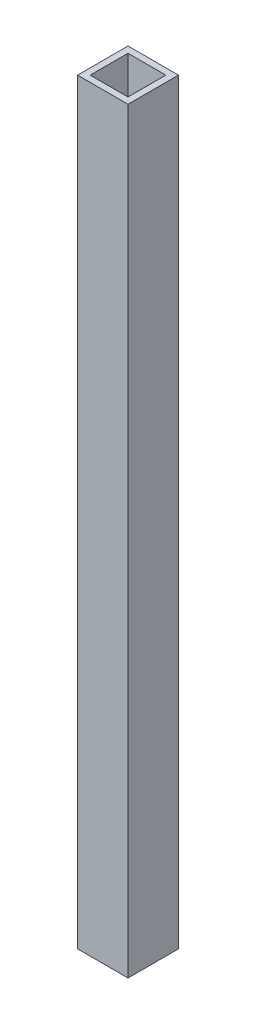
ISO-10303-21;
HEADER;
FILE_DESCRIPTION(('STEP AP214'),'2;1');
FILE_NAME('part.step','',(''),(''),'','','');
FILE_SCHEMA(('AUTOMOTIVE_DESIGN { 1 0 10303 214 1 1 1 1 }'));
ENDSEC;
DATA;
#1=APPLICATION_CONTEXT('core data for automotive mechanical design processes');
#2=APPLICATION_PROTOCOL_DEFINITION('international standard','automotive_design',2000,#1);
#3=PRODUCT_CONTEXT('',#1,'mechanical');
#4=PRODUCT('Part','Part','',(#3));
#5=PRODUCT_RELATED_PRODUCT_CATEGORY('part','',(#4));
#6=PRODUCT_DEFINITION_FORMATION('','',#4);
#7=PRODUCT_DEFINITION_CONTEXT('part definition',#1,'design');
#8=PRODUCT_DEFINITION('design','',#6,#7);
#9=PRODUCT_DEFINITION_SHAPE('','',#8);
#10=(LENGTH_UNIT() NAMED_UNIT(*) SI_UNIT(.MILLI.,.METRE.));
#11=(NAMED_UNIT(*) PLANE_ANGLE_UNIT() SI_UNIT($,.RADIAN.));
#12=(NAMED_UNIT(*) SI_UNIT($,.STERADIAN.) SOLID_ANGLE_UNIT());
#13=UNCERTAINTY_MEASURE_WITH_UNIT(LENGTH_MEASURE(1.E-05),#10,'distance_accuracy_value','');
#14=(GEOMETRIC_REPRESENTATION_CONTEXT(3) GLOBAL_UNCERTAINTY_ASSIGNED_CONTEXT((#13)) GLOBAL_UNIT_ASSIGNED_CONTEXT((#10,
#11,#12)) REPRESENTATION_CONTEXT('',''));
#15=CARTESIAN_POINT('',(0.,0.,0.));
#16=DIRECTION('',(0.,0.,1.));
#17=DIRECTION('',(1.,0.,0.));
#18=AXIS2_PLACEMENT_3D('',#15,#16,#17);
#19=CARTESIAN_POINT('',(0.,190.5,0.));
#20=DIRECTION('',(0.,-1.,0.));
#21=DIRECTION('',(0.,0.,-1.));
#22=AXIS2_PLACEMENT_3D('',#19,#20,#21);
#23=PLANE('',#22);
#24=DIRECTION('',(0.,0.,1.));
#25=VECTOR('',#24,1.);
#26=CARTESIAN_POINT('',(0.,190.5,0.));
#27=LINE('',#26,#25);
#28=CARTESIAN_POINT('',(0.,190.5,-12.7));
#29=VERTEX_POINT('',#28);
#30=CARTESIAN_POINT('',(0.,190.5,0.));
#31=VERTEX_POINT('',#30);
#32=EDGE_CURVE('E134',#29,#31,#27,.T.);
#33=ORIENTED_EDGE('',*,*,#32,.T.);
#34=DIRECTION('',(1.,0.,0.));
#35=VECTOR('',#34,1.);
#36=CARTESIAN_POINT('',(0.,190.5,0.));
#37=LINE('',#36,#35);
#38=CARTESIAN_POINT('',(12.7,190.5,0.));
#39=VERTEX_POINT('',#38);
#40=EDGE_CURVE('E137',#31,#39,#37,.T.);
#41=ORIENTED_EDGE('',*,*,#40,.T.);
#42=DIRECTION('',(0.,0.,-1.));
#43=VECTOR('',#42,1.);
#44=CARTESIAN_POINT('',(12.7,190.5,0.));
#45=LINE('',#44,#43);
#46=CARTESIAN_POINT('',(12.7,190.5,-12.7));
#47=VERTEX_POINT('',#46);
#48=EDGE_CURVE('E140',#39,#47,#45,.T.);
#49=ORIENTED_EDGE('',*,*,#48,.T.);
#50=DIRECTION('',(-1.,0.,0.));
#51=VECTOR('',#50,1.);
#52=CARTESIAN_POINT('',(0.,190.5,-12.7));
#53=LINE('',#52,#51);
#54=EDGE_CURVE('E142',#47,#29,#53,.T.);
#55=ORIENTED_EDGE('',*,*,#54,.T.);
#56=EDGE_LOOP('',(#33,#41,#49,#55));
#57=FACE_BOUND('',#56,.T.);
#58=DIRECTION('',(0.,0.,1.));
#59=VECTOR('',#58,1.);
#60=CARTESIAN_POINT('',(1.5875,190.5,-1.5875));
#61=LINE('',#60,#59);
#62=CARTESIAN_POINT('',(1.5875,190.5,-11.1125));
#63=VERTEX_POINT('',#62);
#64=CARTESIAN_POINT('',(1.5875,190.5,-1.5875));
#65=VERTEX_POINT('',#64);
#66=EDGE_CURVE('E98',#63,#65,#61,.T.);
#67=ORIENTED_EDGE('',*,*,#66,.F.);
#68=DIRECTION('',(-1.,0.,0.));
#69=VECTOR('',#68,1.);
#70=CARTESIAN_POINT('',(1.5875,190.5,-11.1125));
#71=LINE('',#70,#69);
#72=CARTESIAN_POINT('',(11.1125,190.5,-11.1125));
#73=VERTEX_POINT('',#72);
#74=EDGE_CURVE('E120',#73,#63,#71,.T.);
#75=ORIENTED_EDGE('',*,*,#74,.F.);
#76=DIRECTION('',(0.,0.,-1.));
#77=VECTOR('',#76,1.);
#78=CARTESIAN_POINT('',(11.1125,190.5,-1.5875));
#79=LINE('',#78,#77);
#80=CARTESIAN_POINT('',(11.1125,190.5,-1.5875));
#81=VERTEX_POINT('',#80);
#82=EDGE_CURVE('E118',#81,#73,#79,.T.);
#83=ORIENTED_EDGE('',*,*,#82,.F.);
#84=DIRECTION('',(1.,0.,0.));
#85=VECTOR('',#84,1.);
#86=CARTESIAN_POINT('',(1.5875,190.5,-1.5875));
#87=LINE('',#86,#85);
#88=EDGE_CURVE('E106',#65,#81,#87,.T.);
#89=ORIENTED_EDGE('',*,*,#88,.F.);
#90=EDGE_LOOP('',(#67,#75,#83,#89));
#91=FACE_BOUND('',#90,.T.);
#92=ADVANCED_FACE('F33',(#57,#91),#23,.F.);
#93=CARTESIAN_POINT('',(0.,0.,0.));
#94=DIRECTION('',(0.,-1.,0.));
#95=DIRECTION('',(0.,0.,-1.));
#96=AXIS2_PLACEMENT_3D('',#93,#94,#95);
#97=PLANE('',#96);
#98=DIRECTION('',(0.,0.,1.));
#99=VECTOR('',#98,1.);
#100=CARTESIAN_POINT('',(0.,0.,0.));
#101=LINE('',#100,#99);
#102=CARTESIAN_POINT('',(0.,0.,-12.7));
#103=VERTEX_POINT('',#102);
#104=CARTESIAN_POINT('',(0.,0.,0.));
#105=VERTEX_POINT('',#104);
#106=EDGE_CURVE('E114',#103,#105,#101,.T.);
#107=ORIENTED_EDGE('',*,*,#106,.F.);
#108=DIRECTION('',(-1.,0.,0.));
#109=VECTOR('',#108,1.);
#110=CARTESIAN_POINT('',(0.,0.,-12.7));
#111=LINE('',#110,#109);
#112=CARTESIAN_POINT('',(12.7,0.,-12.7));
#113=VERTEX_POINT('',#112);
#114=EDGE_CURVE('E138',#113,#103,#111,.T.);
#115=ORIENTED_EDGE('',*,*,#114,.F.);
#116=DIRECTION('',(0.,0.,-1.));
#117=VECTOR('',#116,1.);
#118=CARTESIAN_POINT('',(12.7,0.,0.));
#119=LINE('',#118,#117);
#120=CARTESIAN_POINT('',(12.7,0.,0.));
#121=VERTEX_POINT('',#120);
#122=EDGE_CURVE('E149',#121,#113,#119,.T.);
#123=ORIENTED_EDGE('',*,*,#122,.F.);
#124=DIRECTION('',(1.,0.,0.));
#125=VECTOR('',#124,1.);
#126=CARTESIAN_POINT('',(0.,0.,0.));
#127=LINE('',#126,#125);
#128=EDGE_CURVE('E147',#105,#121,#127,.T.);
#129=ORIENTED_EDGE('',*,*,#128,.F.);
#130=EDGE_LOOP('',(#107,#115,#123,#129));
#131=FACE_BOUND('',#130,.T.);
#132=DIRECTION('',(-1.,0.,0.));
#133=VECTOR('',#132,1.);
#134=CARTESIAN_POINT('',(1.5875,0.,-11.1125));
#135=LINE('',#134,#133);
#136=CARTESIAN_POINT('',(11.1125,0.,-11.1125));
#137=VERTEX_POINT('',#136);
#138=CARTESIAN_POINT('',(1.5875,0.,-11.1125));
#139=VERTEX_POINT('',#138);
#140=EDGE_CURVE('E107',#137,#139,#135,.T.);
#141=ORIENTED_EDGE('',*,*,#140,.T.);
#142=DIRECTION('',(0.,0.,1.));
#143=VECTOR('',#142,1.);
#144=CARTESIAN_POINT('',(1.5875,0.,-1.5875));
#145=LINE('',#144,#143);
#146=CARTESIAN_POINT('',(1.5875,0.,-1.5875));
#147=VERTEX_POINT('',#146);
#148=EDGE_CURVE('E56',#139,#147,#145,.T.);
#149=ORIENTED_EDGE('',*,*,#148,.T.);
#150=DIRECTION('',(1.,0.,0.));
#151=VECTOR('',#150,1.);
#152=CARTESIAN_POINT('',(1.5875,0.,-1.5875));
#153=LINE('',#152,#151);
#154=CARTESIAN_POINT('',(11.1125,0.,-1.5875));
#155=VERTEX_POINT('',#154);
#156=EDGE_CURVE('E113',#147,#155,#153,.T.);
#157=ORIENTED_EDGE('',*,*,#156,.T.);
#158=DIRECTION('',(0.,0.,-1.));
#159=VECTOR('',#158,1.);
#160=CARTESIAN_POINT('',(11.1125,0.,-1.5875));
#161=LINE('',#160,#159);
#162=EDGE_CURVE('E126',#155,#137,#161,.T.);
#163=ORIENTED_EDGE('',*,*,#162,.T.);
#164=EDGE_LOOP('',(#141,#149,#157,#163));
#165=FACE_BOUND('',#164,.T.);
#166=ADVANCED_FACE('F167',(#131,#165),#97,.T.);
#167=CARTESIAN_POINT('',(0.,190.5,0.));
#168=DIRECTION('',(1.,0.,0.));
#169=DIRECTION('',(0.,0.,-1.));
#170=AXIS2_PLACEMENT_3D('',#167,#168,#169);
#171=PLANE('',#170);
#172=ORIENTED_EDGE('',*,*,#106,.T.);
#173=DIRECTION('',(0.,-1.,0.));
#174=VECTOR('',#173,1.);
#175=CARTESIAN_POINT('',(0.,190.5,0.));
#176=LINE('',#175,#174);
#177=EDGE_CURVE('E11',#31,#105,#176,.T.);
#178=ORIENTED_EDGE('',*,*,#177,.F.);
#179=ORIENTED_EDGE('',*,*,#32,.F.);
#180=DIRECTION('',(0.,-1.,0.));
#181=VECTOR('',#180,1.);
#182=CARTESIAN_POINT('',(0.,190.5,-12.7));
#183=LINE('',#182,#181);
#184=EDGE_CURVE('E144',#29,#103,#183,.T.);
#185=ORIENTED_EDGE('',*,*,#184,.T.);
#186=EDGE_LOOP('',(#172,#178,#179,#185));
#187=FACE_BOUND('',#186,.T.);
#188=ADVANCED_FACE('F35',(#187),#171,.F.);
#189=CARTESIAN_POINT('',(0.,190.5,0.));
#190=DIRECTION('',(0.,0.,-1.));
#191=DIRECTION('',(-1.,0.,0.));
#192=AXIS2_PLACEMENT_3D('',#189,#190,#191);
#193=PLANE('',#192);
#194=ORIENTED_EDGE('',*,*,#128,.T.);
#195=DIRECTION('',(0.,-1.,0.));
#196=VECTOR('',#195,1.);
#197=CARTESIAN_POINT('',(12.7,190.5,0.));
#198=LINE('',#197,#196);
#199=EDGE_CURVE('E41',#39,#121,#198,.T.);
#200=ORIENTED_EDGE('',*,*,#199,.F.);
#201=ORIENTED_EDGE('',*,*,#40,.F.);
#202=ORIENTED_EDGE('',*,*,#177,.T.);
#203=EDGE_LOOP('',(#194,#200,#201,#202));
#204=FACE_BOUND('',#203,.T.);
#205=ADVANCED_FACE('F177',(#204),#193,.F.);
#206=CARTESIAN_POINT('',(12.7,190.5,0.));
#207=DIRECTION('',(-1.,0.,0.));
#208=DIRECTION('',(0.,0.,1.));
#209=AXIS2_PLACEMENT_3D('',#206,#207,#208);
#210=PLANE('',#209);
#211=ORIENTED_EDGE('',*,*,#122,.T.);
#212=DIRECTION('',(0.,-1.,0.));
#213=VECTOR('',#212,1.);
#214=CARTESIAN_POINT('',(12.7,190.5,-12.7));
#215=LINE('',#214,#213);
#216=EDGE_CURVE('E154',#47,#113,#215,.T.);
#217=ORIENTED_EDGE('',*,*,#216,.F.);
#218=ORIENTED_EDGE('',*,*,#48,.F.);
#219=ORIENTED_EDGE('',*,*,#199,.T.);
#220=EDGE_LOOP('',(#211,#217,#218,#219));
#221=FACE_BOUND('',#220,.T.);
#222=ADVANCED_FACE('F161',(#221),#210,.F.);
#223=CARTESIAN_POINT('',(0.,190.5,-12.7));
#224=DIRECTION('',(0.,0.,1.));
#225=DIRECTION('',(1.,0.,0.));
#226=AXIS2_PLACEMENT_3D('',#223,#224,#225);
#227=PLANE('',#226);
#228=ORIENTED_EDGE('',*,*,#114,.T.);
#229=ORIENTED_EDGE('',*,*,#184,.F.);
#230=ORIENTED_EDGE('',*,*,#54,.F.);
#231=ORIENTED_EDGE('',*,*,#216,.T.);
#232=EDGE_LOOP('',(#228,#229,#230,#231));
#233=FACE_BOUND('',#232,.T.);
#234=ADVANCED_FACE('F171',(#233),#227,.F.);
#235=CARTESIAN_POINT('',(1.5875,190.5,-1.5875));
#236=DIRECTION('',(1.,0.,0.));
#237=DIRECTION('',(0.,0.,-1.));
#238=AXIS2_PLACEMENT_3D('',#235,#236,#237);
#239=PLANE('',#238);
#240=ORIENTED_EDGE('',*,*,#148,.F.);
#241=DIRECTION('',(0.,-1.,0.));
#242=VECTOR('',#241,1.);
#243=CARTESIAN_POINT('',(1.5875,190.5,-11.1125));
#244=LINE('',#243,#242);
#245=EDGE_CURVE('E102',#63,#139,#244,.T.);
#246=ORIENTED_EDGE('',*,*,#245,.F.);
#247=ORIENTED_EDGE('',*,*,#66,.T.);
#248=DIRECTION('',(0.,-1.,0.));
#249=VECTOR('',#248,1.);
#250=CARTESIAN_POINT('',(1.5875,190.5,-1.5875));
#251=LINE('',#250,#249);
#252=EDGE_CURVE('E101',#65,#147,#251,.T.);
#253=ORIENTED_EDGE('',*,*,#252,.T.);
#254=EDGE_LOOP('',(#240,#246,#247,#253));
#255=FACE_BOUND('',#254,.T.);
#256=ADVANCED_FACE('F100',(#255),#239,.T.);
#257=CARTESIAN_POINT('',(1.5875,190.5,-1.5875));
#258=DIRECTION('',(0.,0.,-1.));
#259=DIRECTION('',(-1.,0.,0.));
#260=AXIS2_PLACEMENT_3D('',#257,#258,#259);
#261=PLANE('',#260);
#262=ORIENTED_EDGE('',*,*,#156,.F.);
#263=ORIENTED_EDGE('',*,*,#252,.F.);
#264=ORIENTED_EDGE('',*,*,#88,.T.);
#265=DIRECTION('',(0.,-1.,0.));
#266=VECTOR('',#265,1.);
#267=CARTESIAN_POINT('',(11.1125,190.5,-1.5875));
#268=LINE('',#267,#266);
#269=EDGE_CURVE('E115',#81,#155,#268,.T.);
#270=ORIENTED_EDGE('',*,*,#269,.T.);
#271=EDGE_LOOP('',(#262,#263,#264,#270));
#272=FACE_BOUND('',#271,.T.);
#273=ADVANCED_FACE('F110',(#272),#261,.T.);
#274=CARTESIAN_POINT('',(11.1125,190.5,-1.5875));
#275=DIRECTION('',(-1.,0.,0.));
#276=DIRECTION('',(0.,0.,1.));
#277=AXIS2_PLACEMENT_3D('',#274,#275,#276);
#278=PLANE('',#277);
#279=ORIENTED_EDGE('',*,*,#162,.F.);
#280=ORIENTED_EDGE('',*,*,#269,.F.);
#281=ORIENTED_EDGE('',*,*,#82,.T.);
#282=DIRECTION('',(0.,-1.,0.));
#283=VECTOR('',#282,1.);
#284=CARTESIAN_POINT('',(11.1125,190.5,-11.1125));
#285=LINE('',#284,#283);
#286=EDGE_CURVE('E48',#73,#137,#285,.T.);
#287=ORIENTED_EDGE('',*,*,#286,.T.);
#288=EDGE_LOOP('',(#279,#280,#281,#287));
#289=FACE_BOUND('',#288,.T.);
#290=ADVANCED_FACE('F200',(#289),#278,.T.);
#291=CARTESIAN_POINT('',(1.5875,190.5,-11.1125));
#292=DIRECTION('',(0.,0.,1.));
#293=DIRECTION('',(1.,0.,0.));
#294=AXIS2_PLACEMENT_3D('',#291,#292,#293);
#295=PLANE('',#294);
#296=ORIENTED_EDGE('',*,*,#140,.F.);
#297=ORIENTED_EDGE('',*,*,#286,.F.);
#298=ORIENTED_EDGE('',*,*,#74,.T.);
#299=ORIENTED_EDGE('',*,*,#245,.T.);
#300=EDGE_LOOP('',(#296,#297,#298,#299));
#301=FACE_BOUND('',#300,.T.);
#302=ADVANCED_FACE('F204',(#301),#295,.T.);
#303=CLOSED_SHELL('',(#92,#166,#188,#205,#222,#234,#256,#273,#290,#302));
#304=MANIFOLD_SOLID_BREP('B2',#303);
#305=ADVANCED_BREP_SHAPE_REPRESENTATION('',(#18,#304),#14);
#306=SHAPE_DEFINITION_REPRESENTATION(#9,#305);
ENDSEC;
END-ISO-10303-21;
